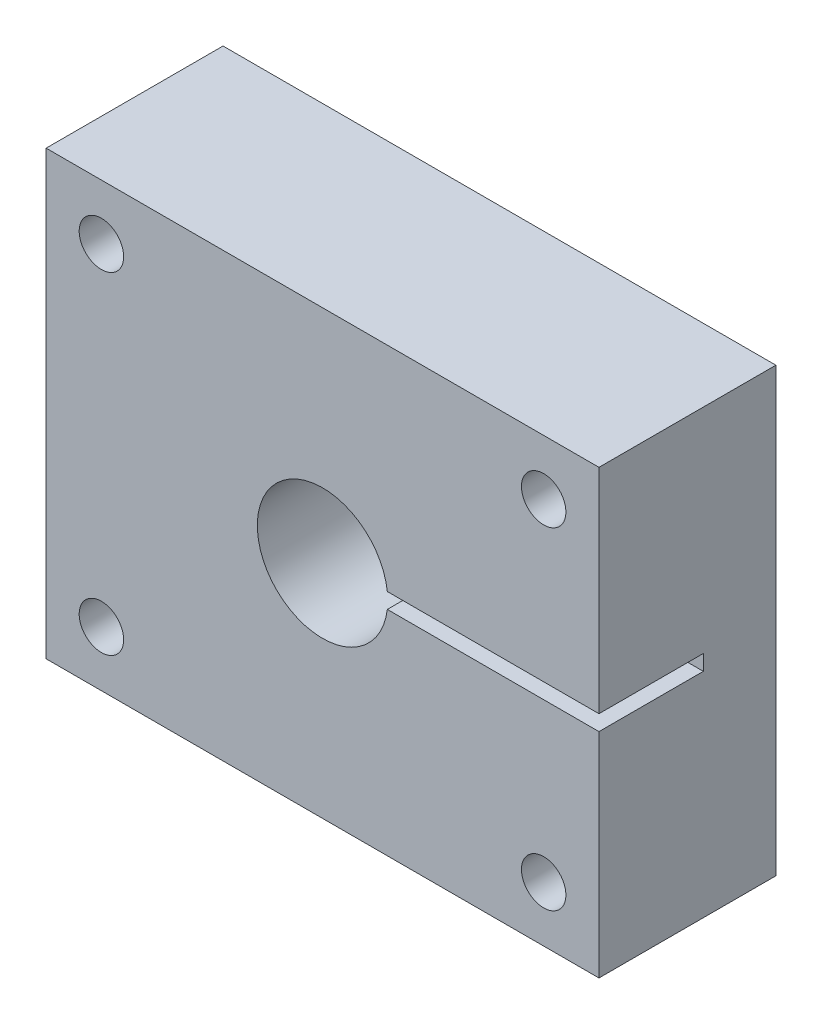
ISO-10303-21;
HEADER;
FILE_DESCRIPTION(('STEP AP214'),'2;1');
FILE_NAME('part.step','',(''),(''),'','','');
FILE_SCHEMA(('AUTOMOTIVE_DESIGN { 1 0 10303 214 1 1 1 1 }'));
ENDSEC;
DATA;
#1=APPLICATION_CONTEXT('core data for automotive mechanical design processes');
#2=APPLICATION_PROTOCOL_DEFINITION('international standard','automotive_design',2000,#1);
#3=PRODUCT_CONTEXT('',#1,'mechanical');
#4=PRODUCT('Part','Part','',(#3));
#5=PRODUCT_RELATED_PRODUCT_CATEGORY('part','',(#4));
#6=PRODUCT_DEFINITION_FORMATION('','',#4);
#7=PRODUCT_DEFINITION_CONTEXT('part definition',#1,'design');
#8=PRODUCT_DEFINITION('design','',#6,#7);
#9=PRODUCT_DEFINITION_SHAPE('','',#8);
#10=(LENGTH_UNIT() NAMED_UNIT(*) SI_UNIT(.MILLI.,.METRE.));
#11=(NAMED_UNIT(*) PLANE_ANGLE_UNIT() SI_UNIT($,.RADIAN.));
#12=(NAMED_UNIT(*) SI_UNIT($,.STERADIAN.) SOLID_ANGLE_UNIT());
#13=UNCERTAINTY_MEASURE_WITH_UNIT(LENGTH_MEASURE(1.E-05),#10,'distance_accuracy_value','');
#14=(GEOMETRIC_REPRESENTATION_CONTEXT(3) GLOBAL_UNCERTAINTY_ASSIGNED_CONTEXT((#13)) GLOBAL_UNIT_ASSIGNED_CONTEXT((#10,
#11,#12)) REPRESENTATION_CONTEXT('',''));
#15=CARTESIAN_POINT('',(0.,0.,0.));
#16=DIRECTION('',(0.,0.,1.));
#17=DIRECTION('',(1.,0.,0.));
#18=AXIS2_PLACEMENT_3D('',#15,#16,#17);
#19=CARTESIAN_POINT('',(31.75,25.4,20.32));
#20=DIRECTION('',(-1.,0.,0.));
#21=DIRECTION('',(0.,-1.,0.));
#22=AXIS2_PLACEMENT_3D('',#19,#20,#21);
#23=PLANE('',#22);
#24=DIRECTION('',(0.,1.,0.));
#25=VECTOR('',#24,1.);
#26=CARTESIAN_POINT('',(31.75,25.4,20.32));
#27=LINE('',#26,#25);
#28=CARTESIAN_POINT('',(31.75,0.88900000000001,20.32));
#29=VERTEX_POINT('',#28);
#30=CARTESIAN_POINT('',(31.75,25.4,20.32));
#31=VERTEX_POINT('',#30);
#32=EDGE_CURVE('E92',#29,#31,#27,.T.);
#33=ORIENTED_EDGE('',*,*,#32,.F.);
#34=DIRECTION('',(0.,0.,1.));
#35=VECTOR('',#34,1.);
#36=CARTESIAN_POINT('',(31.75,0.88900000000001,8.3312));
#37=LINE('',#36,#35);
#38=CARTESIAN_POINT('',(31.75,0.88900000000001,8.3312));
#39=VERTEX_POINT('',#38);
#40=EDGE_CURVE('E133',#39,#29,#37,.T.);
#41=ORIENTED_EDGE('',*,*,#40,.F.);
#42=DIRECTION('',(0.,1.,0.));
#43=VECTOR('',#42,1.);
#44=CARTESIAN_POINT('',(31.75,0.88900000000001,8.3312));
#45=LINE('',#44,#43);
#46=CARTESIAN_POINT('',(31.75,-0.88899999999999,8.3312));
#47=VERTEX_POINT('',#46);
#48=EDGE_CURVE('E117',#47,#39,#45,.T.);
#49=ORIENTED_EDGE('',*,*,#48,.F.);
#50=DIRECTION('',(0.,0.,1.));
#51=VECTOR('',#50,1.);
#52=CARTESIAN_POINT('',(31.75,-0.88899999999999,8.3312));
#53=LINE('',#52,#51);
#54=CARTESIAN_POINT('',(31.75,-0.88899999999999,20.32));
#55=VERTEX_POINT('',#54);
#56=EDGE_CURVE('E126',#47,#55,#53,.T.);
#57=ORIENTED_EDGE('',*,*,#56,.T.);
#58=CARTESIAN_POINT('',(31.75,-25.4,20.32));
#59=VERTEX_POINT('',#58);
#60=EDGE_CURVE('E163',#59,#55,#27,.T.);
#61=ORIENTED_EDGE('',*,*,#60,.F.);
#62=DIRECTION('',(0.,0.,-1.));
#63=VECTOR('',#62,1.);
#64=CARTESIAN_POINT('',(31.75,-25.4,20.32));
#65=LINE('',#64,#63);
#66=CARTESIAN_POINT('',(31.75,-25.4,0.));
#67=VERTEX_POINT('',#66);
#68=EDGE_CURVE('E174',#59,#67,#65,.T.);
#69=ORIENTED_EDGE('',*,*,#68,.T.);
#70=DIRECTION('',(0.,1.,0.));
#71=VECTOR('',#70,1.);
#72=CARTESIAN_POINT('',(31.75,25.4,0.));
#73=LINE('',#72,#71);
#74=CARTESIAN_POINT('',(31.75,25.4,0.));
#75=VERTEX_POINT('',#74);
#76=EDGE_CURVE('E159',#67,#75,#73,.T.);
#77=ORIENTED_EDGE('',*,*,#76,.T.);
#78=DIRECTION('',(0.,0.,-1.));
#79=VECTOR('',#78,1.);
#80=CARTESIAN_POINT('',(31.75,25.4,20.32));
#81=LINE('',#80,#79);
#82=EDGE_CURVE('E11',#31,#75,#81,.T.);
#83=ORIENTED_EDGE('',*,*,#82,.F.);
#84=EDGE_LOOP('',(#33,#41,#49,#57,#61,#69,#77,#83));
#85=FACE_BOUND('',#84,.T.);
#86=ADVANCED_FACE('F39',(#85),#23,.F.);
#87=CARTESIAN_POINT('',(-31.75,25.4,20.32));
#88=DIRECTION('',(0.,-1.,0.));
#89=DIRECTION('',(0.,0.,-1.));
#90=AXIS2_PLACEMENT_3D('',#87,#88,#89);
#91=PLANE('',#90);
#92=DIRECTION('',(-1.,0.,0.));
#93=VECTOR('',#92,1.);
#94=CARTESIAN_POINT('',(-31.75,25.4,0.));
#95=LINE('',#94,#93);
#96=CARTESIAN_POINT('',(-31.75,25.4,0.));
#97=VERTEX_POINT('',#96);
#98=EDGE_CURVE('E178',#75,#97,#95,.T.);
#99=ORIENTED_EDGE('',*,*,#98,.T.);
#100=DIRECTION('',(0.,0.,-1.));
#101=VECTOR('',#100,1.);
#102=CARTESIAN_POINT('',(-31.75,25.4,20.32));
#103=LINE('',#102,#101);
#104=CARTESIAN_POINT('',(-31.75,25.4,20.32));
#105=VERTEX_POINT('',#104);
#106=EDGE_CURVE('E48',#105,#97,#103,.T.);
#107=ORIENTED_EDGE('',*,*,#106,.F.);
#108=DIRECTION('',(-1.,0.,0.));
#109=VECTOR('',#108,1.);
#110=CARTESIAN_POINT('',(-31.75,25.4,20.32));
#111=LINE('',#110,#109);
#112=EDGE_CURVE('E166',#31,#105,#111,.T.);
#113=ORIENTED_EDGE('',*,*,#112,.F.);
#114=ORIENTED_EDGE('',*,*,#82,.T.);
#115=EDGE_LOOP('',(#99,#107,#113,#114));
#116=FACE_BOUND('',#115,.T.);
#117=ADVANCED_FACE('F214',(#116),#91,.F.);
#118=CARTESIAN_POINT('',(-31.75,25.4,20.32));
#119=DIRECTION('',(1.,0.,0.));
#120=DIRECTION('',(0.,1.,0.));
#121=AXIS2_PLACEMENT_3D('',#118,#119,#120);
#122=PLANE('',#121);
#123=DIRECTION('',(0.,-1.,0.));
#124=VECTOR('',#123,1.);
#125=CARTESIAN_POINT('',(-31.75,25.4,0.));
#126=LINE('',#125,#124);
#127=CARTESIAN_POINT('',(-31.75,-25.4,0.));
#128=VERTEX_POINT('',#127);
#129=EDGE_CURVE('E181',#97,#128,#126,.T.);
#130=ORIENTED_EDGE('',*,*,#129,.T.);
#131=DIRECTION('',(0.,0.,-1.));
#132=VECTOR('',#131,1.);
#133=CARTESIAN_POINT('',(-31.75,-25.4,20.32));
#134=LINE('',#133,#132);
#135=CARTESIAN_POINT('',(-31.75,-25.4,20.32));
#136=VERTEX_POINT('',#135);
#137=EDGE_CURVE('E188',#136,#128,#134,.T.);
#138=ORIENTED_EDGE('',*,*,#137,.F.);
#139=DIRECTION('',(0.,-1.,0.));
#140=VECTOR('',#139,1.);
#141=CARTESIAN_POINT('',(-31.75,25.4,20.32));
#142=LINE('',#141,#140);
#143=EDGE_CURVE('E169',#105,#136,#142,.T.);
#144=ORIENTED_EDGE('',*,*,#143,.F.);
#145=ORIENTED_EDGE('',*,*,#106,.T.);
#146=EDGE_LOOP('',(#130,#138,#144,#145));
#147=FACE_BOUND('',#146,.T.);
#148=ADVANCED_FACE('F197',(#147),#122,.F.);
#149=CARTESIAN_POINT('',(-31.75,-25.4,20.32));
#150=DIRECTION('',(0.,1.,0.));
#151=DIRECTION('',(0.,0.,1.));
#152=AXIS2_PLACEMENT_3D('',#149,#150,#151);
#153=PLANE('',#152);
#154=DIRECTION('',(1.,0.,0.));
#155=VECTOR('',#154,1.);
#156=CARTESIAN_POINT('',(-31.75,-25.4,0.));
#157=LINE('',#156,#155);
#158=EDGE_CURVE('E85',#128,#67,#157,.T.);
#159=ORIENTED_EDGE('',*,*,#158,.T.);
#160=ORIENTED_EDGE('',*,*,#68,.F.);
#161=DIRECTION('',(1.,0.,0.));
#162=VECTOR('',#161,1.);
#163=CARTESIAN_POINT('',(-31.75,-25.4,20.32));
#164=LINE('',#163,#162);
#165=EDGE_CURVE('E64',#136,#59,#164,.T.);
#166=ORIENTED_EDGE('',*,*,#165,.F.);
#167=ORIENTED_EDGE('',*,*,#137,.T.);
#168=EDGE_LOOP('',(#159,#160,#166,#167));
#169=FACE_BOUND('',#168,.T.);
#170=ADVANCED_FACE('F204',(#169),#153,.F.);
#171=CARTESIAN_POINT('',(0.,0.,20.32));
#172=DIRECTION('',(0.,0.,1.));
#173=DIRECTION('',(1.,0.,0.));
#174=AXIS2_PLACEMENT_3D('',#171,#172,#173);
#175=PLANE('',#174);
#176=CARTESIAN_POINT('',(-25.4,-19.05,20.32));
#177=DIRECTION('',(0.,0.,-1.));
#178=DIRECTION('',(1.,0.,0.));
#179=AXIS2_PLACEMENT_3D('',#176,#177,#178);
#180=CIRCLE('',#179,2.5527);
#181=CARTESIAN_POINT('',(-22.8473,-19.05,20.32));
#182=VERTEX_POINT('',#181);
#183=EDGE_CURVE('E278',#182,#182,#180,.T.);
#184=ORIENTED_EDGE('',*,*,#183,.T.);
#185=EDGE_LOOP('',(#184));
#186=FACE_BOUND('',#185,.T.);
#187=CARTESIAN_POINT('',(25.4,-19.05,20.32));
#188=DIRECTION('',(0.,0.,1.));
#189=DIRECTION('',(-1.,0.,0.));
#190=AXIS2_PLACEMENT_3D('',#187,#188,#189);
#191=CIRCLE('',#190,2.5527);
#192=CARTESIAN_POINT('',(22.8473,-19.05,20.32));
#193=VERTEX_POINT('',#192);
#194=EDGE_CURVE('E282',#193,#193,#191,.T.);
#195=ORIENTED_EDGE('',*,*,#194,.F.);
#196=EDGE_LOOP('',(#195));
#197=FACE_BOUND('',#196,.T.);
#198=CARTESIAN_POINT('',(25.4,19.05,20.32));
#199=DIRECTION('',(0.,0.,-1.));
#200=DIRECTION('',(-1.,0.,0.));
#201=AXIS2_PLACEMENT_3D('',#198,#199,#200);
#202=CIRCLE('',#201,2.5527);
#203=CARTESIAN_POINT('',(22.8473,19.05,20.32));
#204=VERTEX_POINT('',#203);
#205=EDGE_CURVE('E289',#204,#204,#202,.T.);
#206=ORIENTED_EDGE('',*,*,#205,.T.);
#207=EDGE_LOOP('',(#206));
#208=FACE_BOUND('',#207,.T.);
#209=CARTESIAN_POINT('',(-25.4,19.05,20.32));
#210=DIRECTION('',(0.,0.,1.));
#211=DIRECTION('',(1.,0.,0.));
#212=AXIS2_PLACEMENT_3D('',#209,#210,#211);
#213=CIRCLE('',#212,2.5527);
#214=CARTESIAN_POINT('',(-22.8473,19.05,20.32));
#215=VERTEX_POINT('',#214);
#216=EDGE_CURVE('E297',#215,#215,#213,.T.);
#217=ORIENTED_EDGE('',*,*,#216,.F.);
#218=EDGE_LOOP('',(#217));
#219=FACE_BOUND('',#218,.T.);
#220=DIRECTION('',(-1.,0.,0.));
#221=VECTOR('',#220,1.);
#222=CARTESIAN_POINT('',(0.,0.888999999999994,20.32));
#223=LINE('',#222,#221);
#224=CARTESIAN_POINT('',(7.44007580606542,0.888999999999998,20.32));
#225=VERTEX_POINT('',#224);
#226=EDGE_CURVE('E123',#29,#225,#223,.T.);
#227=ORIENTED_EDGE('',*,*,#226,.F.);
#228=ORIENTED_EDGE('',*,*,#32,.T.);
#229=ORIENTED_EDGE('',*,*,#112,.T.);
#230=ORIENTED_EDGE('',*,*,#143,.T.);
#231=ORIENTED_EDGE('',*,*,#165,.T.);
#232=ORIENTED_EDGE('',*,*,#60,.T.);
#233=DIRECTION('',(1.,0.,0.));
#234=VECTOR('',#233,1.);
#235=CARTESIAN_POINT('',(0.,-0.888999999999994,20.32));
#236=LINE('',#235,#234);
#237=CARTESIAN_POINT('',(7.44007580606542,-0.888999999999993,20.32));
#238=VERTEX_POINT('',#237);
#239=EDGE_CURVE('E129',#238,#55,#236,.T.);
#240=ORIENTED_EDGE('',*,*,#239,.F.);
#241=CARTESIAN_POINT('',(0.,0.,20.32));
#242=DIRECTION('',(0.,0.,1.));
#243=DIRECTION('',(1.,0.,0.));
#244=AXIS2_PLACEMENT_3D('',#241,#242,#243);
#245=CIRCLE('',#244,7.493);
#246=EDGE_CURVE('E156',#225,#238,#245,.T.);
#247=ORIENTED_EDGE('',*,*,#246,.F.);
#248=EDGE_LOOP('',(#227,#228,#229,#230,#231,#232,#240,#247));
#249=FACE_BOUND('',#248,.T.);
#250=ADVANCED_FACE('F206',(#186,#197,#208,#219,#249),#175,.T.);
#251=CARTESIAN_POINT('',(0.,0.,0.));
#252=DIRECTION('',(0.,0.,1.));
#253=DIRECTION('',(1.,0.,0.));
#254=AXIS2_PLACEMENT_3D('',#251,#252,#253);
#255=PLANE('',#254);
#256=CARTESIAN_POINT('',(-25.4,-19.05,0.));
#257=DIRECTION('',(0.,0.,-1.));
#258=DIRECTION('',(1.,0.,0.));
#259=AXIS2_PLACEMENT_3D('',#256,#257,#258);
#260=CIRCLE('',#259,2.5527);
#261=CARTESIAN_POINT('',(-22.8473,-19.05,0.));
#262=VERTEX_POINT('',#261);
#263=EDGE_CURVE('E275',#262,#262,#260,.T.);
#264=ORIENTED_EDGE('',*,*,#263,.F.);
#265=EDGE_LOOP('',(#264));
#266=FACE_BOUND('',#265,.T.);
#267=CARTESIAN_POINT('',(25.4,-19.05,0.));
#268=DIRECTION('',(0.,0.,1.));
#269=DIRECTION('',(-1.,0.,0.));
#270=AXIS2_PLACEMENT_3D('',#267,#268,#269);
#271=CIRCLE('',#270,2.5527);
#272=CARTESIAN_POINT('',(22.8473,-19.05,0.));
#273=VERTEX_POINT('',#272);
#274=EDGE_CURVE('E285',#273,#273,#271,.T.);
#275=ORIENTED_EDGE('',*,*,#274,.T.);
#276=EDGE_LOOP('',(#275));
#277=FACE_BOUND('',#276,.T.);
#278=CARTESIAN_POINT('',(25.4,19.05,0.));
#279=DIRECTION('',(0.,0.,-1.));
#280=DIRECTION('',(-1.,0.,0.));
#281=AXIS2_PLACEMENT_3D('',#278,#279,#280);
#282=CIRCLE('',#281,2.5527);
#283=CARTESIAN_POINT('',(22.8473,19.05,0.));
#284=VERTEX_POINT('',#283);
#285=EDGE_CURVE('E293',#284,#284,#282,.T.);
#286=ORIENTED_EDGE('',*,*,#285,.F.);
#287=EDGE_LOOP('',(#286));
#288=FACE_BOUND('',#287,.T.);
#289=CARTESIAN_POINT('',(-25.4,19.05,0.));
#290=DIRECTION('',(0.,0.,1.));
#291=DIRECTION('',(1.,0.,0.));
#292=AXIS2_PLACEMENT_3D('',#289,#290,#291);
#293=CIRCLE('',#292,2.5527);
#294=CARTESIAN_POINT('',(-22.8473,19.05,0.));
#295=VERTEX_POINT('',#294);
#296=EDGE_CURVE('E301',#295,#295,#293,.T.);
#297=ORIENTED_EDGE('',*,*,#296,.T.);
#298=EDGE_LOOP('',(#297));
#299=FACE_BOUND('',#298,.T.);
#300=CARTESIAN_POINT('',(0.,0.,0.));
#301=DIRECTION('',(0.,0.,-1.));
#302=DIRECTION('',(-1.,0.,0.));
#303=AXIS2_PLACEMENT_3D('',#300,#301,#302);
#304=CIRCLE('',#303,7.493);
#305=CARTESIAN_POINT('',(-7.493,0.,0.));
#306=VERTEX_POINT('',#305);
#307=EDGE_CURVE('E305',#306,#306,#304,.T.);
#308=ORIENTED_EDGE('',*,*,#307,.F.);
#309=EDGE_LOOP('',(#308));
#310=FACE_BOUND('',#309,.T.);
#311=ORIENTED_EDGE('',*,*,#76,.F.);
#312=ORIENTED_EDGE('',*,*,#158,.F.);
#313=ORIENTED_EDGE('',*,*,#129,.F.);
#314=ORIENTED_EDGE('',*,*,#98,.F.);
#315=EDGE_LOOP('',(#311,#312,#313,#314));
#316=FACE_BOUND('',#315,.T.);
#317=ADVANCED_FACE('F202',(#266,#277,#288,#299,#310,#316),#255,.F.);
#318=CARTESIAN_POINT('',(0.,0.,8.3312));
#319=DIRECTION('',(0.,0.,1.));
#320=DIRECTION('',(1.,0.,0.));
#321=AXIS2_PLACEMENT_3D('',#318,#319,#320);
#322=CYLINDRICAL_SURFACE('',#321,7.493);
#323=CARTESIAN_POINT('',(0.,0.,8.3312));
#324=DIRECTION('',(0.,0.,1.));
#325=DIRECTION('',(1.,0.,0.));
#326=AXIS2_PLACEMENT_3D('',#323,#324,#325);
#327=CIRCLE('',#326,7.493);
#328=CARTESIAN_POINT('',(7.44007580606542,0.888999999999998,8.3312));
#329=VERTEX_POINT('',#328);
#330=CARTESIAN_POINT('',(7.44007580606542,-0.888999999999993,8.3312));
#331=VERTEX_POINT('',#330);
#332=EDGE_CURVE('E119',#329,#331,#327,.T.);
#333=ORIENTED_EDGE('',*,*,#332,.F.);
#334=DIRECTION('',(0.,0.,1.));
#335=VECTOR('',#334,1.);
#336=CARTESIAN_POINT('',(7.44007580606542,0.888999999999998,8.3312));
#337=LINE('',#336,#335);
#338=EDGE_CURVE('E152',#329,#225,#337,.T.);
#339=ORIENTED_EDGE('',*,*,#338,.T.);
#340=ORIENTED_EDGE('',*,*,#246,.T.);
#341=DIRECTION('',(0.,0.,1.));
#342=VECTOR('',#341,1.);
#343=CARTESIAN_POINT('',(7.44007580606542,-0.888999999999993,8.3312));
#344=LINE('',#343,#342);
#345=EDGE_CURVE('E148',#238,#331,#344,.F.);
#346=ORIENTED_EDGE('',*,*,#345,.T.);
#347=EDGE_LOOP('',(#333,#339,#340,#346));
#348=FACE_BOUND('',#347,.T.);
#349=ADVANCED_FACE('F228',(#348),#322,.F.);
#350=CARTESIAN_POINT('',(0.,0.,8.3312));
#351=DIRECTION('',(0.,0.,1.));
#352=DIRECTION('',(1.,0.,0.));
#353=AXIS2_PLACEMENT_3D('',#350,#351,#352);
#354=PLANE('',#353);
#355=CARTESIAN_POINT('',(0.,0.,8.3312));
#356=DIRECTION('',(0.,0.,1.));
#357=DIRECTION('',(1.,0.,0.));
#358=AXIS2_PLACEMENT_3D('',#355,#356,#357);
#359=CIRCLE('',#358,1.9939);
#360=CARTESIAN_POINT('',(1.9939,0.,8.3312));
#361=VERTEX_POINT('',#360);
#362=EDGE_CURVE('E144',#361,#361,#359,.T.);
#363=ORIENTED_EDGE('',*,*,#362,.F.);
#364=EDGE_LOOP('',(#363));
#365=FACE_BOUND('',#364,.T.);
#366=ORIENTED_EDGE('',*,*,#332,.T.);
#367=DIRECTION('',(1.,0.,0.));
#368=VECTOR('',#367,1.);
#369=CARTESIAN_POINT('',(0.,-0.888999999999994,8.3312));
#370=LINE('',#369,#368);
#371=EDGE_CURVE('E113',#331,#47,#370,.T.);
#372=ORIENTED_EDGE('',*,*,#371,.T.);
#373=ORIENTED_EDGE('',*,*,#48,.T.);
#374=DIRECTION('',(-1.,0.,0.));
#375=VECTOR('',#374,1.);
#376=CARTESIAN_POINT('',(0.,0.888999999999994,8.3312));
#377=LINE('',#376,#375);
#378=EDGE_CURVE('E55',#39,#329,#377,.T.);
#379=ORIENTED_EDGE('',*,*,#378,.T.);
#380=EDGE_LOOP('',(#366,#372,#373,#379));
#381=FACE_BOUND('',#380,.T.);
#382=ADVANCED_FACE('F115',(#365,#381),#354,.T.);
#383=CARTESIAN_POINT('',(0.,0.888999999999994,8.3312));
#384=DIRECTION('',(0.,1.,0.));
#385=DIRECTION('',(-1.,0.,0.));
#386=AXIS2_PLACEMENT_3D('',#383,#384,#385);
#387=PLANE('',#386);
#388=ORIENTED_EDGE('',*,*,#378,.F.);
#389=ORIENTED_EDGE('',*,*,#40,.T.);
#390=ORIENTED_EDGE('',*,*,#226,.T.);
#391=ORIENTED_EDGE('',*,*,#338,.F.);
#392=EDGE_LOOP('',(#388,#389,#390,#391));
#393=FACE_BOUND('',#392,.T.);
#394=ADVANCED_FACE('F226',(#393),#387,.F.);
#395=CARTESIAN_POINT('',(0.,-0.888999999999994,8.3312));
#396=DIRECTION('',(0.,-1.,0.));
#397=DIRECTION('',(1.,0.,0.));
#398=AXIS2_PLACEMENT_3D('',#395,#396,#397);
#399=PLANE('',#398);
#400=ORIENTED_EDGE('',*,*,#239,.T.);
#401=ORIENTED_EDGE('',*,*,#56,.F.);
#402=ORIENTED_EDGE('',*,*,#371,.F.);
#403=ORIENTED_EDGE('',*,*,#345,.F.);
#404=EDGE_LOOP('',(#400,#401,#402,#403));
#405=FACE_BOUND('',#404,.T.);
#406=ADVANCED_FACE('F127',(#405),#399,.F.);
#407=CARTESIAN_POINT('',(0.,0.,-3.6576));
#408=DIRECTION('',(0.,0.,1.));
#409=DIRECTION('',(1.,0.,0.));
#410=AXIS2_PLACEMENT_3D('',#407,#408,#409);
#411=CYLINDRICAL_SURFACE('',#410,1.9939);
#412=CARTESIAN_POINT('',(0.,0.,6.331204));
#413=DIRECTION('',(0.,0.,1.));
#414=DIRECTION('',(1.,0.,0.));
#415=AXIS2_PLACEMENT_3D('',#412,#413,#414);
#416=CIRCLE('',#415,1.9939);
#417=CARTESIAN_POINT('',(1.9939,0.,6.331204));
#418=VERTEX_POINT('',#417);
#419=EDGE_CURVE('E42',#418,#418,#416,.F.);
#420=ORIENTED_EDGE('',*,*,#419,.T.);
#421=EDGE_LOOP('',(#420));
#422=FACE_BOUND('',#421,.T.);
#423=ORIENTED_EDGE('',*,*,#362,.T.);
#424=EDGE_LOOP('',(#423));
#425=FACE_BOUND('',#424,.T.);
#426=ADVANCED_FACE('F241',(#422,#425),#411,.F.);
#427=CARTESIAN_POINT('',(0.,0.,6.331204));
#428=DIRECTION('',(0.,0.,1.));
#429=DIRECTION('',(1.,0.,0.));
#430=AXIS2_PLACEMENT_3D('',#427,#428,#429);
#431=PLANE('',#430);
#432=CARTESIAN_POINT('',(0.,0.,6.331204));
#433=DIRECTION('',(0.,0.,1.));
#434=DIRECTION('',(1.,0.,0.));
#435=AXIS2_PLACEMENT_3D('',#432,#433,#434);
#436=CIRCLE('',#435,7.493);
#437=CARTESIAN_POINT('',(7.493,0.,6.331204));
#438=VERTEX_POINT('',#437);
#439=EDGE_CURVE('E312',#438,#438,#436,.F.);
#440=ORIENTED_EDGE('',*,*,#439,.T.);
#441=EDGE_LOOP('',(#440));
#442=FACE_BOUND('',#441,.T.);
#443=ORIENTED_EDGE('',*,*,#419,.F.);
#444=EDGE_LOOP('',(#443));
#445=FACE_BOUND('',#444,.T.);
#446=ADVANCED_FACE('F246',(#442,#445),#431,.F.);
#447=CARTESIAN_POINT('',(0.,0.,27.5246084457232));
#448=DIRECTION('',(0.,0.,-1.));
#449=DIRECTION('',(-1.,0.,0.));
#450=AXIS2_PLACEMENT_3D('',#447,#448,#449);
#451=CYLINDRICAL_SURFACE('',#450,7.493);
#452=ORIENTED_EDGE('',*,*,#307,.T.);
#453=EDGE_LOOP('',(#452));
#454=FACE_BOUND('',#453,.T.);
#455=ORIENTED_EDGE('',*,*,#439,.F.);
#456=EDGE_LOOP('',(#455));
#457=FACE_BOUND('',#456,.T.);
#458=ADVANCED_FACE('F250',(#454,#457),#451,.F.);
#459=CARTESIAN_POINT('',(-25.4,19.05,0.));
#460=DIRECTION('',(0.,0.,1.));
#461=DIRECTION('',(1.,0.,0.));
#462=AXIS2_PLACEMENT_3D('',#459,#460,#461);
#463=CYLINDRICAL_SURFACE('',#462,2.5527);
#464=ORIENTED_EDGE('',*,*,#296,.F.);
#465=EDGE_LOOP('',(#464));
#466=FACE_BOUND('',#465,.T.);
#467=ORIENTED_EDGE('',*,*,#216,.T.);
#468=EDGE_LOOP('',(#467));
#469=FACE_BOUND('',#468,.T.);
#470=ADVANCED_FACE('F254',(#466,#469),#463,.F.);
#471=CARTESIAN_POINT('',(25.4,19.05,0.));
#472=DIRECTION('',(0.,0.,1.));
#473=DIRECTION('',(1.,0.,0.));
#474=AXIS2_PLACEMENT_3D('',#471,#472,#473);
#475=CYLINDRICAL_SURFACE('',#474,2.5527);
#476=ORIENTED_EDGE('',*,*,#285,.T.);
#477=EDGE_LOOP('',(#476));
#478=FACE_BOUND('',#477,.T.);
#479=ORIENTED_EDGE('',*,*,#205,.F.);
#480=EDGE_LOOP('',(#479));
#481=FACE_BOUND('',#480,.T.);
#482=ADVANCED_FACE('F258',(#478,#481),#475,.F.);
#483=CARTESIAN_POINT('',(25.4,-19.05,0.));
#484=DIRECTION('',(0.,0.,1.));
#485=DIRECTION('',(1.,0.,0.));
#486=AXIS2_PLACEMENT_3D('',#483,#484,#485);
#487=CYLINDRICAL_SURFACE('',#486,2.5527);
#488=ORIENTED_EDGE('',*,*,#274,.F.);
#489=EDGE_LOOP('',(#488));
#490=FACE_BOUND('',#489,.T.);
#491=ORIENTED_EDGE('',*,*,#194,.T.);
#492=EDGE_LOOP('',(#491));
#493=FACE_BOUND('',#492,.T.);
#494=ADVANCED_FACE('F262',(#490,#493),#487,.F.);
#495=CARTESIAN_POINT('',(-25.4,-19.05,0.));
#496=DIRECTION('',(0.,0.,1.));
#497=DIRECTION('',(1.,0.,0.));
#498=AXIS2_PLACEMENT_3D('',#495,#496,#497);
#499=CYLINDRICAL_SURFACE('',#498,2.5527);
#500=ORIENTED_EDGE('',*,*,#263,.T.);
#501=EDGE_LOOP('',(#500));
#502=FACE_BOUND('',#501,.T.);
#503=ORIENTED_EDGE('',*,*,#183,.F.);
#504=EDGE_LOOP('',(#503));
#505=FACE_BOUND('',#504,.T.);
#506=ADVANCED_FACE('F266',(#502,#505),#499,.F.);
#507=CLOSED_SHELL('',(#86,#117,#148,#170,#250,#317,#349,#382,#394,#406,#426,#446,#458,#470,#482,
#494,#506));
#508=MANIFOLD_SOLID_BREP('B2',#507);
#509=ADVANCED_BREP_SHAPE_REPRESENTATION('',(#18,#508),#14);
#510=SHAPE_DEFINITION_REPRESENTATION(#9,#509);
ENDSEC;
END-ISO-10303-21;
